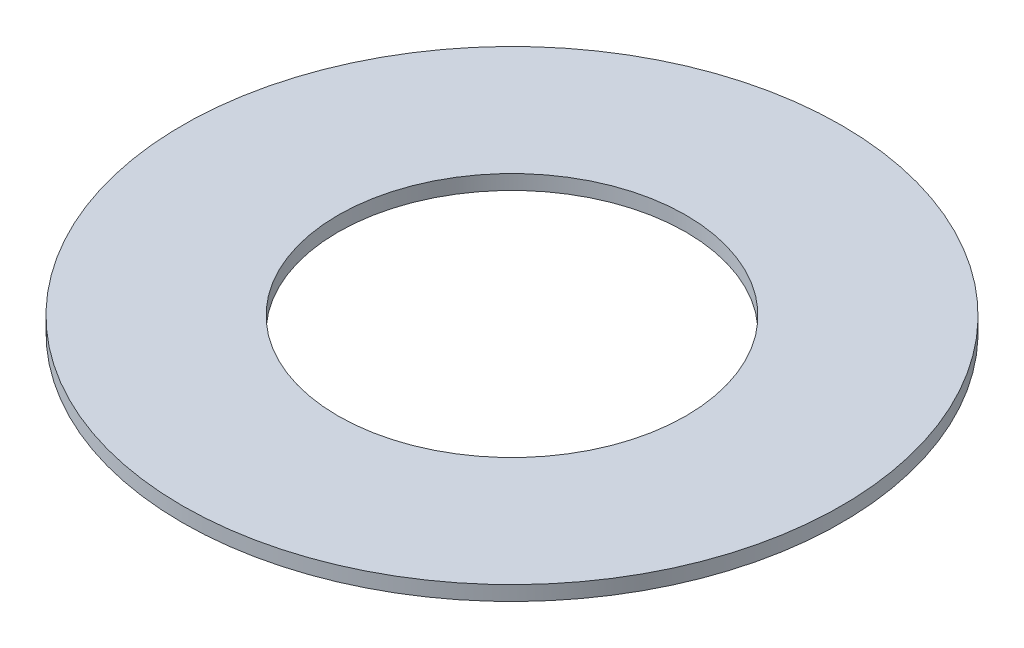
ISO-10303-21;
HEADER;
FILE_DESCRIPTION(('STEP AP214'),'2;1');
FILE_NAME('part.step','',(''),(''),'','','');
FILE_SCHEMA(('AUTOMOTIVE_DESIGN { 1 0 10303 214 1 1 1 1 }'));
ENDSEC;
DATA;
#1=APPLICATION_CONTEXT('core data for automotive mechanical design processes');
#2=APPLICATION_PROTOCOL_DEFINITION('international standard','automotive_design',2000,#1);
#3=PRODUCT_CONTEXT('',#1,'mechanical');
#4=PRODUCT('Part','Part','',(#3));
#5=PRODUCT_RELATED_PRODUCT_CATEGORY('part','',(#4));
#6=PRODUCT_DEFINITION_FORMATION('','',#4);
#7=PRODUCT_DEFINITION_CONTEXT('part definition',#1,'design');
#8=PRODUCT_DEFINITION('design','',#6,#7);
#9=PRODUCT_DEFINITION_SHAPE('','',#8);
#10=(LENGTH_UNIT() NAMED_UNIT(*) SI_UNIT(.MILLI.,.METRE.));
#11=(NAMED_UNIT(*) PLANE_ANGLE_UNIT() SI_UNIT($,.RADIAN.));
#12=(NAMED_UNIT(*) SI_UNIT($,.STERADIAN.) SOLID_ANGLE_UNIT());
#13=UNCERTAINTY_MEASURE_WITH_UNIT(LENGTH_MEASURE(1.E-05),#10,'distance_accuracy_value','');
#14=(GEOMETRIC_REPRESENTATION_CONTEXT(3) GLOBAL_UNCERTAINTY_ASSIGNED_CONTEXT((#13)) GLOBAL_UNIT_ASSIGNED_CONTEXT((#10,
#11,#12)) REPRESENTATION_CONTEXT('',''));
#15=CARTESIAN_POINT('',(0.,0.,0.));
#16=DIRECTION('',(0.,0.,1.));
#17=DIRECTION('',(1.,0.,0.));
#18=AXIS2_PLACEMENT_3D('',#15,#16,#17);
#19=CARTESIAN_POINT('',(0.,4.,0.));
#20=DIRECTION('',(0.,-1.,0.));
#21=DIRECTION('',(0.,0.,-1.));
#22=AXIS2_PLACEMENT_3D('',#19,#20,#21);
#23=CYLINDRICAL_SURFACE('',#22,90.);
#24=CARTESIAN_POINT('',(0.,4.,0.));
#25=DIRECTION('',(0.,1.,0.));
#26=DIRECTION('',(0.,0.,1.));
#27=AXIS2_PLACEMENT_3D('',#24,#25,#26);
#28=CIRCLE('',#27,90.);
#29=CARTESIAN_POINT('',(0.,4.,90.));
#30=VERTEX_POINT('',#29);
#31=EDGE_CURVE('E10',#30,#30,#28,.T.);
#32=ORIENTED_EDGE('',*,*,#31,.F.);
#33=EDGE_LOOP('',(#32));
#34=FACE_BOUND('',#33,.T.);
#35=CARTESIAN_POINT('',(0.,0.,0.));
#36=DIRECTION('',(0.,1.,0.));
#37=DIRECTION('',(0.,0.,1.));
#38=AXIS2_PLACEMENT_3D('',#35,#36,#37);
#39=CIRCLE('',#38,90.);
#40=CARTESIAN_POINT('',(0.,0.,90.));
#41=VERTEX_POINT('',#40);
#42=EDGE_CURVE('E37',#41,#41,#39,.T.);
#43=ORIENTED_EDGE('',*,*,#42,.T.);
#44=EDGE_LOOP('',(#43));
#45=FACE_BOUND('',#44,.T.);
#46=ADVANCED_FACE('F40',(#34,#45),#23,.T.);
#47=CARTESIAN_POINT('',(0.,4.,0.));
#48=DIRECTION('',(0.,1.,0.));
#49=DIRECTION('',(0.,0.,1.));
#50=AXIS2_PLACEMENT_3D('',#47,#48,#49);
#51=PLANE('',#50);
#52=CARTESIAN_POINT('',(0.,4.,0.));
#53=DIRECTION('',(0.,1.,0.));
#54=DIRECTION('',(0.,0.,1.));
#55=AXIS2_PLACEMENT_3D('',#52,#53,#54);
#56=CIRCLE('',#55,47.5);
#57=CARTESIAN_POINT('',(0.,4.,47.5));
#58=VERTEX_POINT('',#57);
#59=EDGE_CURVE('E50',#58,#58,#56,.T.);
#60=ORIENTED_EDGE('',*,*,#59,.F.);
#61=EDGE_LOOP('',(#60));
#62=FACE_BOUND('',#61,.T.);
#63=ORIENTED_EDGE('',*,*,#31,.T.);
#64=EDGE_LOOP('',(#63));
#65=FACE_BOUND('',#64,.T.);
#66=ADVANCED_FACE('F59',(#62,#65),#51,.T.);
#67=CARTESIAN_POINT('',(0.,0.,0.));
#68=DIRECTION('',(0.,1.,0.));
#69=DIRECTION('',(0.,0.,1.));
#70=AXIS2_PLACEMENT_3D('',#67,#68,#69);
#71=PLANE('',#70);
#72=CARTESIAN_POINT('',(0.,0.,0.));
#73=DIRECTION('',(0.,1.,0.));
#74=DIRECTION('',(0.,0.,1.));
#75=AXIS2_PLACEMENT_3D('',#72,#73,#74);
#76=CIRCLE('',#75,47.5);
#77=CARTESIAN_POINT('',(0.,0.,47.5));
#78=VERTEX_POINT('',#77);
#79=EDGE_CURVE('E47',#78,#78,#76,.T.);
#80=ORIENTED_EDGE('',*,*,#79,.T.);
#81=EDGE_LOOP('',(#80));
#82=FACE_BOUND('',#81,.T.);
#83=ORIENTED_EDGE('',*,*,#42,.F.);
#84=EDGE_LOOP('',(#83));
#85=FACE_BOUND('',#84,.T.);
#86=ADVANCED_FACE('F58',(#82,#85),#71,.F.);
#87=CARTESIAN_POINT('',(0.,4.,0.));
#88=DIRECTION('',(0.,-1.,0.));
#89=DIRECTION('',(0.,0.,-1.));
#90=AXIS2_PLACEMENT_3D('',#87,#88,#89);
#91=CYLINDRICAL_SURFACE('',#90,47.5);
#92=ORIENTED_EDGE('',*,*,#59,.T.);
#93=EDGE_LOOP('',(#92));
#94=FACE_BOUND('',#93,.T.);
#95=ORIENTED_EDGE('',*,*,#79,.F.);
#96=EDGE_LOOP('',(#95));
#97=FACE_BOUND('',#96,.T.);
#98=ADVANCED_FACE('F54',(#94,#97),#91,.F.);
#99=CLOSED_SHELL('',(#46,#66,#86,#98));
#100=MANIFOLD_SOLID_BREP('B2',#99);
#101=ADVANCED_BREP_SHAPE_REPRESENTATION('',(#18,#100),#14);
#102=SHAPE_DEFINITION_REPRESENTATION(#9,#101);
ENDSEC;
END-ISO-10303-21;
